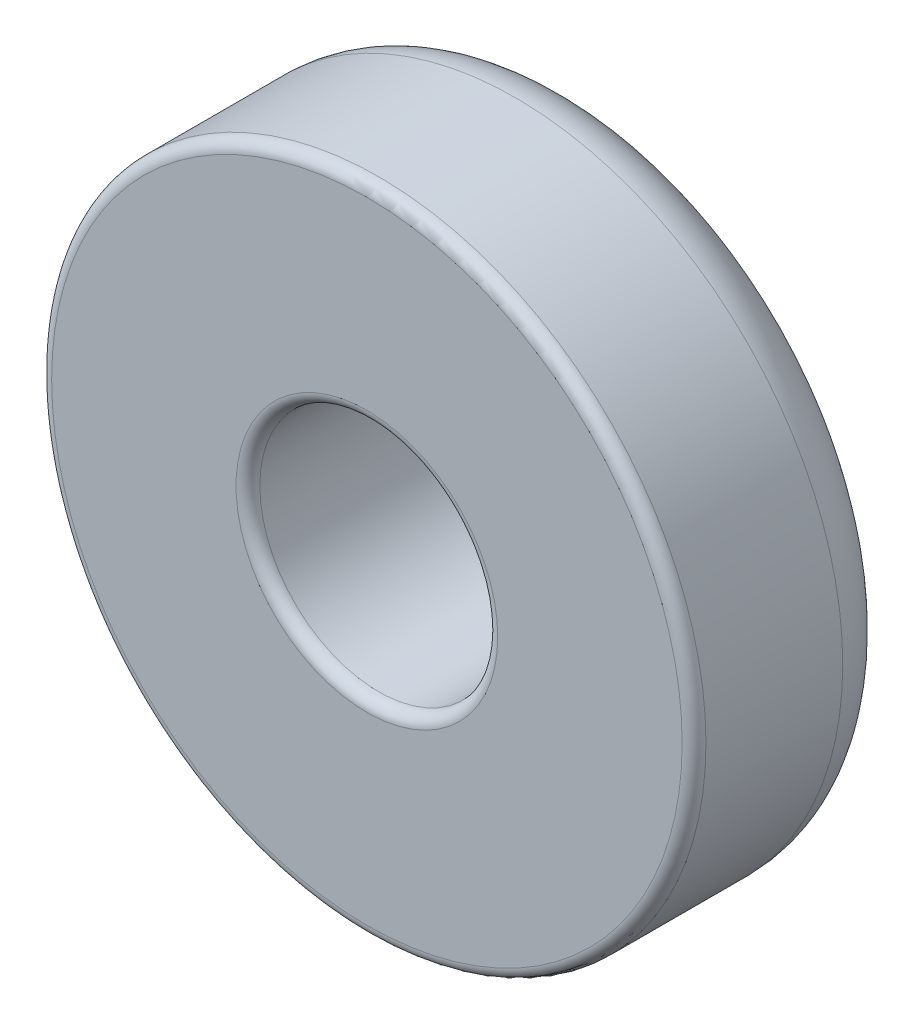
ISO-10303-21;
HEADER;
FILE_DESCRIPTION(('STEP AP214'),'2;1');
FILE_NAME('part.step','',(''),(''),'','','');
FILE_SCHEMA(('AUTOMOTIVE_DESIGN { 1 0 10303 214 1 1 1 1 }'));
ENDSEC;
DATA;
#1=APPLICATION_CONTEXT('core data for automotive mechanical design processes');
#2=APPLICATION_PROTOCOL_DEFINITION('international standard','automotive_design',2000,#1);
#3=PRODUCT_CONTEXT('',#1,'mechanical');
#4=PRODUCT('Part','Part','',(#3));
#5=PRODUCT_RELATED_PRODUCT_CATEGORY('part','',(#4));
#6=PRODUCT_DEFINITION_FORMATION('','',#4);
#7=PRODUCT_DEFINITION_CONTEXT('part definition',#1,'design');
#8=PRODUCT_DEFINITION('design','',#6,#7);
#9=PRODUCT_DEFINITION_SHAPE('','',#8);
#10=(LENGTH_UNIT() NAMED_UNIT(*) SI_UNIT(.MILLI.,.METRE.));
#11=(NAMED_UNIT(*) PLANE_ANGLE_UNIT() SI_UNIT($,.RADIAN.));
#12=(NAMED_UNIT(*) SI_UNIT($,.STERADIAN.) SOLID_ANGLE_UNIT());
#13=UNCERTAINTY_MEASURE_WITH_UNIT(LENGTH_MEASURE(1.E-05),#10,'distance_accuracy_value','');
#14=(GEOMETRIC_REPRESENTATION_CONTEXT(3) GLOBAL_UNCERTAINTY_ASSIGNED_CONTEXT((#13)) GLOBAL_UNIT_ASSIGNED_CONTEXT((#10,
#11,#12)) REPRESENTATION_CONTEXT('',''));
#15=CARTESIAN_POINT('',(0.,0.,0.));
#16=DIRECTION('',(0.,0.,1.));
#17=DIRECTION('',(1.,0.,0.));
#18=AXIS2_PLACEMENT_3D('',#15,#16,#17);
#19=CARTESIAN_POINT('',(0.,0.,1.75));
#20=DIRECTION('',(0.,0.,1.));
#21=DIRECTION('',(1.,0.,0.));
#22=AXIS2_PLACEMENT_3D('',#19,#20,#21);
#23=PLANE('',#22);
#24=CARTESIAN_POINT('',(0.,0.,1.75));
#25=DIRECTION('',(0.,0.,1.));
#26=DIRECTION('',(1.,0.,0.));
#27=AXIS2_PLACEMENT_3D('',#24,#25,#26);
#28=CIRCLE('',#27,1.1);
#29=CARTESIAN_POINT('',(1.1,0.,1.75));
#30=VERTEX_POINT('',#29);
#31=EDGE_CURVE('E45',#30,#30,#28,.F.);
#32=ORIENTED_EDGE('',*,*,#31,.T.);
#33=EDGE_LOOP('',(#32));
#34=FACE_BOUND('',#33,.T.);
#35=CARTESIAN_POINT('',(0.,0.,1.75));
#36=DIRECTION('',(0.,0.,1.));
#37=DIRECTION('',(1.,0.,0.));
#38=AXIS2_PLACEMENT_3D('',#35,#36,#37);
#39=CIRCLE('',#38,2.65);
#40=CARTESIAN_POINT('',(2.65,0.,1.75));
#41=VERTEX_POINT('',#40);
#42=EDGE_CURVE('E49',#41,#41,#39,.T.);
#43=ORIENTED_EDGE('',*,*,#42,.T.);
#44=EDGE_LOOP('',(#43));
#45=FACE_BOUND('',#44,.T.);
#46=ADVANCED_FACE('F38',(#34,#45),#23,.T.);
#47=CARTESIAN_POINT('',(0.,0.,0.));
#48=DIRECTION('',(0.,0.,1.));
#49=DIRECTION('',(1.,0.,0.));
#50=AXIS2_PLACEMENT_3D('',#47,#48,#49);
#51=PLANE('',#50);
#52=CARTESIAN_POINT('',(0.,0.,0.));
#53=DIRECTION('',(0.,0.,1.));
#54=DIRECTION('',(1.,0.,0.));
#55=AXIS2_PLACEMENT_3D('',#52,#53,#54);
#56=CIRCLE('',#55,1.1);
#57=CARTESIAN_POINT('',(1.1,0.,0.));
#58=VERTEX_POINT('',#57);
#59=EDGE_CURVE('E61',#58,#58,#56,.T.);
#60=ORIENTED_EDGE('',*,*,#59,.T.);
#61=EDGE_LOOP('',(#60));
#62=FACE_BOUND('',#61,.T.);
#63=CARTESIAN_POINT('',(0.,0.,0.));
#64=DIRECTION('',(0.,0.,1.));
#65=DIRECTION('',(1.,0.,0.));
#66=AXIS2_PLACEMENT_3D('',#63,#64,#65);
#67=CIRCLE('',#66,2.25);
#68=CARTESIAN_POINT('',(2.25,0.,0.));
#69=VERTEX_POINT('',#68);
#70=EDGE_CURVE('E64',#69,#69,#67,.F.);
#71=ORIENTED_EDGE('',*,*,#70,.T.);
#72=EDGE_LOOP('',(#71));
#73=FACE_BOUND('',#72,.T.);
#74=ADVANCED_FACE('F91',(#62,#73),#51,.F.);
#75=CARTESIAN_POINT('',(0.,0.,1.75));
#76=DIRECTION('',(0.,0.,-1.));
#77=DIRECTION('',(-1.,0.,0.));
#78=AXIS2_PLACEMENT_3D('',#75,#76,#77);
#79=CYLINDRICAL_SURFACE('',#78,2.75);
#80=CARTESIAN_POINT('',(0.,0.,1.65));
#81=DIRECTION('',(0.,0.,1.));
#82=DIRECTION('',(1.,0.,0.));
#83=AXIS2_PLACEMENT_3D('',#80,#81,#82);
#84=CIRCLE('',#83,2.75);
#85=CARTESIAN_POINT('',(2.75,0.,1.65));
#86=VERTEX_POINT('',#85);
#87=EDGE_CURVE('E11',#86,#86,#84,.F.);
#88=ORIENTED_EDGE('',*,*,#87,.T.);
#89=EDGE_LOOP('',(#88));
#90=FACE_BOUND('',#89,.T.);
#91=CARTESIAN_POINT('',(0.,0.,0.5));
#92=DIRECTION('',(0.,0.,1.));
#93=DIRECTION('',(1.,0.,0.));
#94=AXIS2_PLACEMENT_3D('',#91,#92,#93);
#95=CIRCLE('',#94,2.75);
#96=CARTESIAN_POINT('',(2.75,0.,0.5));
#97=VERTEX_POINT('',#96);
#98=EDGE_CURVE('E67',#97,#97,#95,.T.);
#99=ORIENTED_EDGE('',*,*,#98,.T.);
#100=EDGE_LOOP('',(#99));
#101=FACE_BOUND('',#100,.T.);
#102=ADVANCED_FACE('F71',(#90,#101),#79,.T.);
#103=CARTESIAN_POINT('',(0.,0.,1.75));
#104=DIRECTION('',(0.,0.,-1.));
#105=DIRECTION('',(-1.,0.,0.));
#106=AXIS2_PLACEMENT_3D('',#103,#104,#105);
#107=CYLINDRICAL_SURFACE('',#106,1.);
#108=CARTESIAN_POINT('',(0.,0.,0.1));
#109=DIRECTION('',(0.,0.,1.));
#110=DIRECTION('',(1.,0.,0.));
#111=AXIS2_PLACEMENT_3D('',#108,#109,#110);
#112=CIRCLE('',#111,1.);
#113=CARTESIAN_POINT('',(1.,0.,0.1));
#114=VERTEX_POINT('',#113);
#115=EDGE_CURVE('E53',#114,#114,#112,.F.);
#116=ORIENTED_EDGE('',*,*,#115,.T.);
#117=EDGE_LOOP('',(#116));
#118=FACE_BOUND('',#117,.T.);
#119=CARTESIAN_POINT('',(0.,0.,1.65));
#120=DIRECTION('',(0.,0.,1.));
#121=DIRECTION('',(1.,0.,0.));
#122=AXIS2_PLACEMENT_3D('',#119,#120,#121);
#123=CIRCLE('',#122,1.);
#124=CARTESIAN_POINT('',(1.,0.,1.65));
#125=VERTEX_POINT('',#124);
#126=EDGE_CURVE('E58',#125,#125,#123,.T.);
#127=ORIENTED_EDGE('',*,*,#126,.T.);
#128=EDGE_LOOP('',(#127));
#129=FACE_BOUND('',#128,.T.);
#130=ADVANCED_FACE('F76',(#118,#129),#107,.F.);
#131=CARTESIAN_POINT('',(0.,0.,0.5));
#132=DIRECTION('',(0.,0.,1.));
#133=DIRECTION('',(1.,0.,0.));
#134=AXIS2_PLACEMENT_3D('',#131,#132,#133);
#135=TOROIDAL_SURFACE('',#134,2.25,0.5);
#136=ORIENTED_EDGE('',*,*,#70,.F.);
#137=EDGE_LOOP('',(#136));
#138=FACE_BOUND('',#137,.T.);
#139=ORIENTED_EDGE('',*,*,#98,.F.);
#140=EDGE_LOOP('',(#139));
#141=FACE_BOUND('',#140,.T.);
#142=ADVANCED_FACE('F73',(#138,#141),#135,.T.);
#143=CARTESIAN_POINT('',(0.,0.,0.1));
#144=DIRECTION('',(0.,0.,1.));
#145=DIRECTION('',(1.,0.,0.));
#146=AXIS2_PLACEMENT_3D('',#143,#144,#145);
#147=TOROIDAL_SURFACE('',#146,1.1,0.1);
#148=ORIENTED_EDGE('',*,*,#115,.F.);
#149=EDGE_LOOP('',(#148));
#150=FACE_BOUND('',#149,.T.);
#151=ORIENTED_EDGE('',*,*,#59,.F.);
#152=EDGE_LOOP('',(#151));
#153=FACE_BOUND('',#152,.T.);
#154=ADVANCED_FACE('F75',(#150,#153),#147,.T.);
#155=CARTESIAN_POINT('',(0.,0.,1.65));
#156=DIRECTION('',(0.,0.,1.));
#157=DIRECTION('',(1.,0.,0.));
#158=AXIS2_PLACEMENT_3D('',#155,#156,#157);
#159=TOROIDAL_SURFACE('',#158,1.1,0.1);
#160=ORIENTED_EDGE('',*,*,#31,.F.);
#161=EDGE_LOOP('',(#160));
#162=FACE_BOUND('',#161,.T.);
#163=ORIENTED_EDGE('',*,*,#126,.F.);
#164=EDGE_LOOP('',(#163));
#165=FACE_BOUND('',#164,.T.);
#166=ADVANCED_FACE('F83',(#162,#165),#159,.T.);
#167=CARTESIAN_POINT('',(0.,0.,1.65));
#168=DIRECTION('',(0.,0.,1.));
#169=DIRECTION('',(1.,0.,0.));
#170=AXIS2_PLACEMENT_3D('',#167,#168,#169);
#171=TOROIDAL_SURFACE('',#170,2.65,0.1);
#172=ORIENTED_EDGE('',*,*,#87,.F.);
#173=EDGE_LOOP('',(#172));
#174=FACE_BOUND('',#173,.T.);
#175=ORIENTED_EDGE('',*,*,#42,.F.);
#176=EDGE_LOOP('',(#175));
#177=FACE_BOUND('',#176,.T.);
#178=ADVANCED_FACE('F40',(#174,#177),#171,.T.);
#179=CLOSED_SHELL('',(#46,#74,#102,#130,#142,#154,#166,#178));
#180=MANIFOLD_SOLID_BREP('B2',#179);
#181=ADVANCED_BREP_SHAPE_REPRESENTATION('',(#18,#180),#14);
#182=SHAPE_DEFINITION_REPRESENTATION(#9,#181);
ENDSEC;
END-ISO-10303-21;
